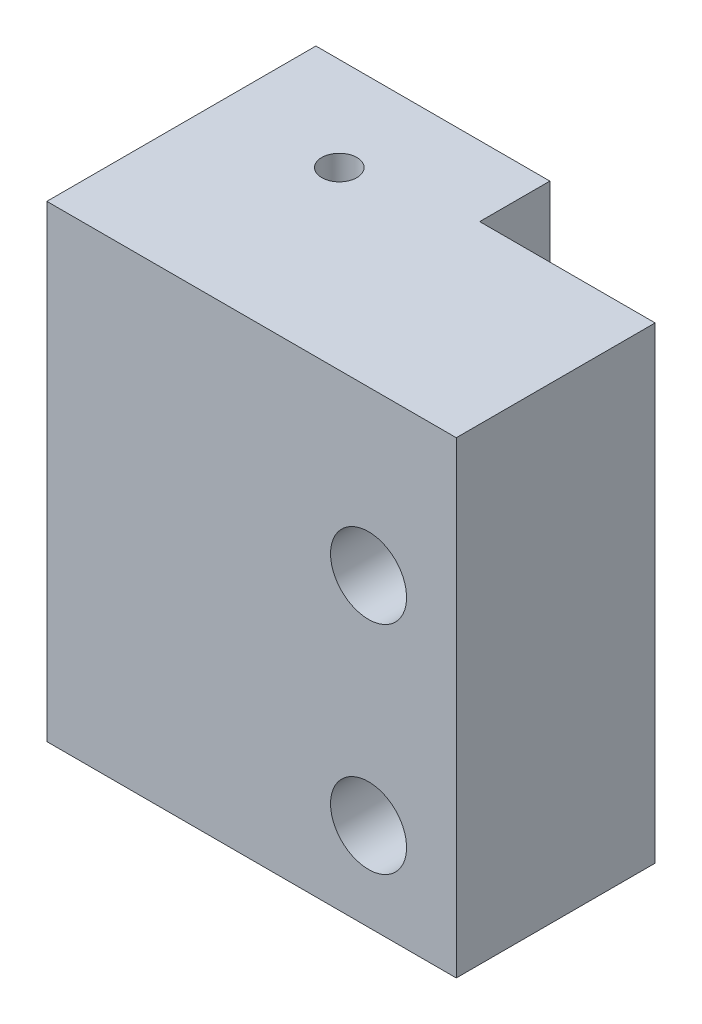
ISO-10303-21;
HEADER;
FILE_DESCRIPTION(('STEP AP214'),'2;1');
FILE_NAME('part.step','',(''),(''),'','','');
FILE_SCHEMA(('AUTOMOTIVE_DESIGN { 1 0 10303 214 1 1 1 1 }'));
ENDSEC;
DATA;
#1=APPLICATION_CONTEXT('core data for automotive mechanical design processes');
#2=APPLICATION_PROTOCOL_DEFINITION('international standard','automotive_design',2000,#1);
#3=PRODUCT_CONTEXT('',#1,'mechanical');
#4=PRODUCT('Part','Part','',(#3));
#5=PRODUCT_RELATED_PRODUCT_CATEGORY('part','',(#4));
#6=PRODUCT_DEFINITION_FORMATION('','',#4);
#7=PRODUCT_DEFINITION_CONTEXT('part definition',#1,'design');
#8=PRODUCT_DEFINITION('design','',#6,#7);
#9=PRODUCT_DEFINITION_SHAPE('','',#8);
#10=(LENGTH_UNIT() NAMED_UNIT(*) SI_UNIT(.MILLI.,.METRE.));
#11=(NAMED_UNIT(*) PLANE_ANGLE_UNIT() SI_UNIT($,.RADIAN.));
#12=(NAMED_UNIT(*) SI_UNIT($,.STERADIAN.) SOLID_ANGLE_UNIT());
#13=UNCERTAINTY_MEASURE_WITH_UNIT(LENGTH_MEASURE(1.E-05),#10,'distance_accuracy_value','');
#14=(GEOMETRIC_REPRESENTATION_CONTEXT(3) GLOBAL_UNCERTAINTY_ASSIGNED_CONTEXT((#13)) GLOBAL_UNIT_ASSIGNED_CONTEXT((#10,
#11,#12)) REPRESENTATION_CONTEXT('',''));
#15=CARTESIAN_POINT('',(0.,0.,0.));
#16=DIRECTION('',(0.,0.,1.));
#17=DIRECTION('',(1.,0.,0.));
#18=AXIS2_PLACEMENT_3D('',#15,#16,#17);
#19=CARTESIAN_POINT('',(-10.,40.,22.257459708235));
#20=DIRECTION('',(0.,0.,-1.));
#21=DIRECTION('',(-1.,0.,0.));
#22=AXIS2_PLACEMENT_3D('',#19,#20,#21);
#23=PLANE('',#22);
#24=CARTESIAN_POINT('',(17.5,7.53529097812589,22.257459708235));
#25=DIRECTION('',(0.,0.,-1.));
#26=DIRECTION('',(-1.,0.,0.));
#27=AXIS2_PLACEMENT_3D('',#24,#25,#26);
#28=CIRCLE('',#27,3.25);
#29=CARTESIAN_POINT('',(14.25,7.53529097812589,22.257459708235));
#30=VERTEX_POINT('',#29);
#31=EDGE_CURVE('E176',#30,#30,#28,.F.);
#32=ORIENTED_EDGE('',*,*,#31,.F.);
#33=EDGE_LOOP('',(#32));
#34=FACE_BOUND('',#33,.T.);
#35=CARTESIAN_POINT('',(17.5,26.0457705473982,22.257459708235));
#36=DIRECTION('',(0.,0.,-1.));
#37=DIRECTION('',(-1.,0.,0.));
#38=AXIS2_PLACEMENT_3D('',#35,#36,#37);
#39=CIRCLE('',#38,3.25);
#40=CARTESIAN_POINT('',(14.25,26.0457705473982,22.257459708235));
#41=VERTEX_POINT('',#40);
#42=EDGE_CURVE('E180',#41,#41,#39,.F.);
#43=ORIENTED_EDGE('',*,*,#42,.F.);
#44=EDGE_LOOP('',(#43));
#45=FACE_BOUND('',#44,.T.);
#46=DIRECTION('',(1.,0.,0.));
#47=VECTOR('',#46,1.);
#48=CARTESIAN_POINT('',(-10.,0.,22.257459708235));
#49=LINE('',#48,#47);
#50=CARTESIAN_POINT('',(-10.,0.,22.257459708235));
#51=VERTEX_POINT('',#50);
#52=CARTESIAN_POINT('',(25.,0.,22.257459708235));
#53=VERTEX_POINT('',#52);
#54=EDGE_CURVE('E133',#51,#53,#49,.T.);
#55=ORIENTED_EDGE('',*,*,#54,.T.);
#56=DIRECTION('',(0.,-1.,0.));
#57=VECTOR('',#56,1.);
#58=CARTESIAN_POINT('',(25.,40.,22.257459708235));
#59=LINE('',#58,#57);
#60=CARTESIAN_POINT('',(25.,40.,22.257459708235));
#61=VERTEX_POINT('',#60);
#62=EDGE_CURVE('E49',#61,#53,#59,.T.);
#63=ORIENTED_EDGE('',*,*,#62,.F.);
#64=DIRECTION('',(1.,0.,0.));
#65=VECTOR('',#64,1.);
#66=CARTESIAN_POINT('',(-10.,40.,22.257459708235));
#67=LINE('',#66,#65);
#68=CARTESIAN_POINT('',(-10.,40.,22.257459708235));
#69=VERTEX_POINT('',#68);
#70=EDGE_CURVE('E95',#69,#61,#67,.T.);
#71=ORIENTED_EDGE('',*,*,#70,.F.);
#72=DIRECTION('',(0.,-1.,0.));
#73=VECTOR('',#72,1.);
#74=CARTESIAN_POINT('',(-10.,40.,22.257459708235));
#75=LINE('',#74,#73);
#76=EDGE_CURVE('E11',#69,#51,#75,.T.);
#77=ORIENTED_EDGE('',*,*,#76,.T.);
#78=EDGE_LOOP('',(#55,#63,#71,#77));
#79=FACE_BOUND('',#78,.T.);
#80=ADVANCED_FACE('F39',(#34,#45,#79),#23,.F.);
#81=CARTESIAN_POINT('',(25.,40.,5.25745970823498));
#82=DIRECTION('',(-1.,0.,0.));
#83=DIRECTION('',(0.,0.,1.));
#84=AXIS2_PLACEMENT_3D('',#81,#82,#83);
#85=PLANE('',#84);
#86=DIRECTION('',(0.,0.,-1.));
#87=VECTOR('',#86,1.);
#88=CARTESIAN_POINT('',(25.,0.,5.25745970823498));
#89=LINE('',#88,#87);
#90=CARTESIAN_POINT('',(25.,0.,5.25745970823498));
#91=VERTEX_POINT('',#90);
#92=EDGE_CURVE('E136',#53,#91,#89,.T.);
#93=ORIENTED_EDGE('',*,*,#92,.T.);
#94=DIRECTION('',(0.,-1.,0.));
#95=VECTOR('',#94,1.);
#96=CARTESIAN_POINT('',(25.,40.,5.25745970823498));
#97=LINE('',#96,#95);
#98=CARTESIAN_POINT('',(25.,40.,5.25745970823498));
#99=VERTEX_POINT('',#98);
#100=EDGE_CURVE('E120',#99,#91,#97,.T.);
#101=ORIENTED_EDGE('',*,*,#100,.F.);
#102=DIRECTION('',(0.,0.,-1.));
#103=VECTOR('',#102,1.);
#104=CARTESIAN_POINT('',(25.,40.,5.25745970823498));
#105=LINE('',#104,#103);
#106=EDGE_CURVE('E109',#61,#99,#105,.T.);
#107=ORIENTED_EDGE('',*,*,#106,.F.);
#108=ORIENTED_EDGE('',*,*,#62,.T.);
#109=EDGE_LOOP('',(#93,#101,#107,#108));
#110=FACE_BOUND('',#109,.T.);
#111=ADVANCED_FACE('F159',(#110),#85,.F.);
#112=CARTESIAN_POINT('',(10.,40.,5.25745970823498));
#113=DIRECTION('',(0.,0.,1.));
#114=DIRECTION('',(1.,0.,0.));
#115=AXIS2_PLACEMENT_3D('',#112,#113,#114);
#116=PLANE('',#115);
#117=CARTESIAN_POINT('',(17.5,7.53529097812589,5.25745970823498));
#118=DIRECTION('',(0.,0.,-1.));
#119=DIRECTION('',(-1.,0.,0.));
#120=AXIS2_PLACEMENT_3D('',#117,#118,#119);
#121=CIRCLE('',#120,3.25);
#122=CARTESIAN_POINT('',(14.25,7.53529097812589,5.25745970823498));
#123=VERTEX_POINT('',#122);
#124=EDGE_CURVE('E184',#123,#123,#121,.T.);
#125=ORIENTED_EDGE('',*,*,#124,.F.);
#126=EDGE_LOOP('',(#125));
#127=FACE_BOUND('',#126,.T.);
#128=CARTESIAN_POINT('',(17.5,26.0457705473982,5.25745970823498));
#129=DIRECTION('',(0.,0.,-1.));
#130=DIRECTION('',(-1.,0.,0.));
#131=AXIS2_PLACEMENT_3D('',#128,#129,#130);
#132=CIRCLE('',#131,3.25);
#133=CARTESIAN_POINT('',(14.25,26.0457705473982,5.25745970823498));
#134=VERTEX_POINT('',#133);
#135=EDGE_CURVE('E185',#134,#134,#132,.T.);
#136=ORIENTED_EDGE('',*,*,#135,.F.);
#137=EDGE_LOOP('',(#136));
#138=FACE_BOUND('',#137,.T.);
#139=DIRECTION('',(-1.,0.,0.));
#140=VECTOR('',#139,1.);
#141=CARTESIAN_POINT('',(10.,0.,5.25745970823498));
#142=LINE('',#141,#140);
#143=CARTESIAN_POINT('',(10.,0.,5.25745970823498));
#144=VERTEX_POINT('',#143);
#145=EDGE_CURVE('E118',#91,#144,#142,.T.);
#146=ORIENTED_EDGE('',*,*,#145,.T.);
#147=DIRECTION('',(0.,-1.,0.));
#148=VECTOR('',#147,1.);
#149=CARTESIAN_POINT('',(10.,40.,5.25745970823498));
#150=LINE('',#149,#148);
#151=CARTESIAN_POINT('',(10.,40.,5.25745970823498));
#152=VERTEX_POINT('',#151);
#153=EDGE_CURVE('E115',#152,#144,#150,.T.);
#154=ORIENTED_EDGE('',*,*,#153,.F.);
#155=DIRECTION('',(-1.,0.,0.));
#156=VECTOR('',#155,1.);
#157=CARTESIAN_POINT('',(10.,40.,5.25745970823498));
#158=LINE('',#157,#156);
#159=EDGE_CURVE('E103',#99,#152,#158,.T.);
#160=ORIENTED_EDGE('',*,*,#159,.F.);
#161=ORIENTED_EDGE('',*,*,#100,.T.);
#162=EDGE_LOOP('',(#146,#154,#160,#161));
#163=FACE_BOUND('',#162,.T.);
#164=ADVANCED_FACE('F116',(#127,#138,#163),#116,.F.);
#165=CARTESIAN_POINT('',(10.,40.,-0.742540291765022));
#166=DIRECTION('',(-1.,0.,0.));
#167=DIRECTION('',(0.,0.,1.));
#168=AXIS2_PLACEMENT_3D('',#165,#166,#167);
#169=PLANE('',#168);
#170=DIRECTION('',(0.,0.,-1.));
#171=VECTOR('',#170,1.);
#172=CARTESIAN_POINT('',(10.,0.,-0.742540291765022));
#173=LINE('',#172,#171);
#174=CARTESIAN_POINT('',(10.,0.,-0.742540291765022));
#175=VERTEX_POINT('',#174);
#176=EDGE_CURVE('E81',#144,#175,#173,.T.);
#177=ORIENTED_EDGE('',*,*,#176,.T.);
#178=DIRECTION('',(0.,-1.,0.));
#179=VECTOR('',#178,1.);
#180=CARTESIAN_POINT('',(10.,40.,-0.742540291765022));
#181=LINE('',#180,#179);
#182=CARTESIAN_POINT('',(10.,40.,-0.742540291765022));
#183=VERTEX_POINT('',#182);
#184=EDGE_CURVE('E121',#183,#175,#181,.T.);
#185=ORIENTED_EDGE('',*,*,#184,.F.);
#186=DIRECTION('',(0.,0.,-1.));
#187=VECTOR('',#186,1.);
#188=CARTESIAN_POINT('',(10.,40.,-0.742540291765022));
#189=LINE('',#188,#187);
#190=EDGE_CURVE('E107',#152,#183,#189,.T.);
#191=ORIENTED_EDGE('',*,*,#190,.F.);
#192=ORIENTED_EDGE('',*,*,#153,.T.);
#193=EDGE_LOOP('',(#177,#185,#191,#192));
#194=FACE_BOUND('',#193,.T.);
#195=ADVANCED_FACE('F123',(#194),#169,.F.);
#196=CARTESIAN_POINT('',(-10.,40.,-0.742540291765022));
#197=DIRECTION('',(0.,0.,1.));
#198=DIRECTION('',(1.,0.,0.));
#199=AXIS2_PLACEMENT_3D('',#196,#197,#198);
#200=PLANE('',#199);
#201=DIRECTION('',(-1.,0.,0.));
#202=VECTOR('',#201,1.);
#203=CARTESIAN_POINT('',(-10.,0.,-0.742540291765022));
#204=LINE('',#203,#202);
#205=CARTESIAN_POINT('',(-10.,0.,-0.742540291765022));
#206=VERTEX_POINT('',#205);
#207=EDGE_CURVE('E88',#175,#206,#204,.T.);
#208=ORIENTED_EDGE('',*,*,#207,.T.);
#209=DIRECTION('',(0.,-1.,0.));
#210=VECTOR('',#209,1.);
#211=CARTESIAN_POINT('',(-10.,40.,-0.742540291765022));
#212=LINE('',#211,#210);
#213=CARTESIAN_POINT('',(-10.,40.,-0.742540291765022));
#214=VERTEX_POINT('',#213);
#215=EDGE_CURVE('E129',#214,#206,#212,.T.);
#216=ORIENTED_EDGE('',*,*,#215,.F.);
#217=DIRECTION('',(-1.,0.,0.));
#218=VECTOR('',#217,1.);
#219=CARTESIAN_POINT('',(-10.,40.,-0.742540291765022));
#220=LINE('',#219,#218);
#221=EDGE_CURVE('E126',#183,#214,#220,.T.);
#222=ORIENTED_EDGE('',*,*,#221,.F.);
#223=ORIENTED_EDGE('',*,*,#184,.T.);
#224=EDGE_LOOP('',(#208,#216,#222,#223));
#225=FACE_BOUND('',#224,.T.);
#226=ADVANCED_FACE('F165',(#225),#200,.F.);
#227=CARTESIAN_POINT('',(-10.,40.,5.25745970823498));
#228=DIRECTION('',(1.,0.,0.));
#229=DIRECTION('',(0.,0.,-1.));
#230=AXIS2_PLACEMENT_3D('',#227,#228,#229);
#231=PLANE('',#230);
#232=DIRECTION('',(0.,0.,1.));
#233=VECTOR('',#232,1.);
#234=CARTESIAN_POINT('',(-10.,0.,5.25745970823498));
#235=LINE('',#234,#233);
#236=EDGE_CURVE('E146',#206,#51,#235,.T.);
#237=ORIENTED_EDGE('',*,*,#236,.T.);
#238=ORIENTED_EDGE('',*,*,#76,.F.);
#239=DIRECTION('',(0.,0.,1.));
#240=VECTOR('',#239,1.);
#241=CARTESIAN_POINT('',(-10.,40.,5.25745970823498));
#242=LINE('',#241,#240);
#243=EDGE_CURVE('E57',#214,#69,#242,.T.);
#244=ORIENTED_EDGE('',*,*,#243,.F.);
#245=ORIENTED_EDGE('',*,*,#215,.T.);
#246=EDGE_LOOP('',(#237,#238,#244,#245));
#247=FACE_BOUND('',#246,.T.);
#248=ADVANCED_FACE('F164',(#247),#231,.F.);
#249=CARTESIAN_POINT('',(0.,40.,0.));
#250=DIRECTION('',(0.,1.,0.));
#251=DIRECTION('',(0.,0.,1.));
#252=AXIS2_PLACEMENT_3D('',#249,#250,#251);
#253=PLANE('',#252);
#254=CARTESIAN_POINT('',(0.,40.,7.25745970823498));
#255=DIRECTION('',(0.,1.,0.));
#256=DIRECTION('',(0.,0.,1.));
#257=AXIS2_PLACEMENT_3D('',#254,#255,#256);
#258=CIRCLE('',#257,1.5);
#259=CARTESIAN_POINT('',(0.,40.,8.75745970823498));
#260=VERTEX_POINT('',#259);
#261=EDGE_CURVE('E42',#260,#260,#258,.T.);
#262=ORIENTED_EDGE('',*,*,#261,.F.);
#263=EDGE_LOOP('',(#262));
#264=FACE_BOUND('',#263,.T.);
#265=ORIENTED_EDGE('',*,*,#243,.T.);
#266=ORIENTED_EDGE('',*,*,#70,.T.);
#267=ORIENTED_EDGE('',*,*,#106,.T.);
#268=ORIENTED_EDGE('',*,*,#159,.T.);
#269=ORIENTED_EDGE('',*,*,#190,.T.);
#270=ORIENTED_EDGE('',*,*,#221,.T.);
#271=EDGE_LOOP('',(#265,#266,#267,#268,#269,#270));
#272=FACE_BOUND('',#271,.T.);
#273=ADVANCED_FACE('F105',(#264,#272),#253,.T.);
#274=CARTESIAN_POINT('',(0.,0.,0.));
#275=DIRECTION('',(0.,1.,0.));
#276=DIRECTION('',(0.,0.,1.));
#277=AXIS2_PLACEMENT_3D('',#274,#275,#276);
#278=PLANE('',#277);
#279=CARTESIAN_POINT('',(0.,0.,7.25745970823498));
#280=DIRECTION('',(0.,-1.,0.));
#281=DIRECTION('',(0.,0.,-1.));
#282=AXIS2_PLACEMENT_3D('',#279,#280,#281);
#283=CIRCLE('',#282,4.05);
#284=CARTESIAN_POINT('',(0.,0.,3.20745970823498));
#285=VERTEX_POINT('',#284);
#286=EDGE_CURVE('E171',#285,#285,#283,.T.);
#287=ORIENTED_EDGE('',*,*,#286,.F.);
#288=EDGE_LOOP('',(#287));
#289=FACE_BOUND('',#288,.T.);
#290=ORIENTED_EDGE('',*,*,#54,.F.);
#291=ORIENTED_EDGE('',*,*,#236,.F.);
#292=ORIENTED_EDGE('',*,*,#207,.F.);
#293=ORIENTED_EDGE('',*,*,#176,.F.);
#294=ORIENTED_EDGE('',*,*,#145,.F.);
#295=ORIENTED_EDGE('',*,*,#92,.F.);
#296=EDGE_LOOP('',(#290,#291,#292,#293,#294,#295));
#297=FACE_BOUND('',#296,.T.);
#298=ADVANCED_FACE('F162',(#289,#297),#278,.F.);
#299=CARTESIAN_POINT('',(0.,35.,7.25745970823498));
#300=DIRECTION('',(0.,-1.,0.));
#301=DIRECTION('',(0.,0.,-1.));
#302=AXIS2_PLACEMENT_3D('',#299,#300,#301);
#303=CYLINDRICAL_SURFACE('',#302,4.05);
#304=CARTESIAN_POINT('',(0.,35.,7.25745970823498));
#305=DIRECTION('',(0.,-1.,0.));
#306=DIRECTION('',(0.,0.,-1.));
#307=AXIS2_PLACEMENT_3D('',#304,#305,#306);
#308=CIRCLE('',#307,4.05);
#309=CARTESIAN_POINT('',(0.,35.,3.20745970823498));
#310=VERTEX_POINT('',#309);
#311=EDGE_CURVE('E137',#310,#310,#308,.T.);
#312=ORIENTED_EDGE('',*,*,#311,.F.);
#313=EDGE_LOOP('',(#312));
#314=FACE_BOUND('',#313,.T.);
#315=ORIENTED_EDGE('',*,*,#286,.T.);
#316=EDGE_LOOP('',(#315));
#317=FACE_BOUND('',#316,.T.);
#318=ADVANCED_FACE('F212',(#314,#317),#303,.F.);
#319=CARTESIAN_POINT('',(0.,35.,7.25745970823498));
#320=DIRECTION('',(0.,-1.,0.));
#321=DIRECTION('',(0.,0.,-1.));
#322=AXIS2_PLACEMENT_3D('',#319,#320,#321);
#323=PLANE('',#322);
#324=CARTESIAN_POINT('',(0.,35.,7.25745970823498));
#325=DIRECTION('',(0.,-1.,0.));
#326=DIRECTION('',(0.,0.,-1.));
#327=AXIS2_PLACEMENT_3D('',#324,#325,#326);
#328=CIRCLE('',#327,1.5);
#329=CARTESIAN_POINT('',(0.,35.,5.75745970823498));
#330=VERTEX_POINT('',#329);
#331=EDGE_CURVE('E195',#330,#330,#328,.T.);
#332=ORIENTED_EDGE('',*,*,#331,.F.);
#333=EDGE_LOOP('',(#332));
#334=FACE_BOUND('',#333,.T.);
#335=ORIENTED_EDGE('',*,*,#311,.T.);
#336=EDGE_LOOP('',(#335));
#337=FACE_BOUND('',#336,.T.);
#338=ADVANCED_FACE('F229',(#334,#337),#323,.T.);
#339=CARTESIAN_POINT('',(17.5,26.0457705473982,22.258459708235));
#340=DIRECTION('',(0.,0.,-1.));
#341=DIRECTION('',(-1.,0.,0.));
#342=AXIS2_PLACEMENT_3D('',#339,#340,#341);
#343=CYLINDRICAL_SURFACE('',#342,3.25);
#344=ORIENTED_EDGE('',*,*,#135,.T.);
#345=EDGE_LOOP('',(#344));
#346=FACE_BOUND('',#345,.T.);
#347=ORIENTED_EDGE('',*,*,#42,.T.);
#348=EDGE_LOOP('',(#347));
#349=FACE_BOUND('',#348,.T.);
#350=ADVANCED_FACE('F226',(#346,#349),#343,.F.);
#351=CARTESIAN_POINT('',(17.5,7.53529097812589,22.258459708235));
#352=DIRECTION('',(0.,0.,-1.));
#353=DIRECTION('',(-1.,0.,0.));
#354=AXIS2_PLACEMENT_3D('',#351,#352,#353);
#355=CYLINDRICAL_SURFACE('',#354,3.25);
#356=ORIENTED_EDGE('',*,*,#124,.T.);
#357=EDGE_LOOP('',(#356));
#358=FACE_BOUND('',#357,.T.);
#359=ORIENTED_EDGE('',*,*,#31,.T.);
#360=EDGE_LOOP('',(#359));
#361=FACE_BOUND('',#360,.T.);
#362=ADVANCED_FACE('F228',(#358,#361),#355,.F.);
#363=CARTESIAN_POINT('',(0.,45.,7.25745970823498));
#364=DIRECTION('',(0.,-1.,0.));
#365=DIRECTION('',(0.,0.,-1.));
#366=AXIS2_PLACEMENT_3D('',#363,#364,#365);
#367=CYLINDRICAL_SURFACE('',#366,1.5);
#368=ORIENTED_EDGE('',*,*,#261,.T.);
#369=EDGE_LOOP('',(#368));
#370=FACE_BOUND('',#369,.T.);
#371=ORIENTED_EDGE('',*,*,#331,.T.);
#372=EDGE_LOOP('',(#371));
#373=FACE_BOUND('',#372,.T.);
#374=ADVANCED_FACE('F204',(#370,#373),#367,.F.);
#375=CLOSED_SHELL('',(#80,#111,#164,#195,#226,#248,#273,#298,#318,#338,#350,#362,#374));
#376=MANIFOLD_SOLID_BREP('B2',#375);
#377=ADVANCED_BREP_SHAPE_REPRESENTATION('',(#18,#376),#14);
#378=SHAPE_DEFINITION_REPRESENTATION(#9,#377);
ENDSEC;
END-ISO-10303-21;
